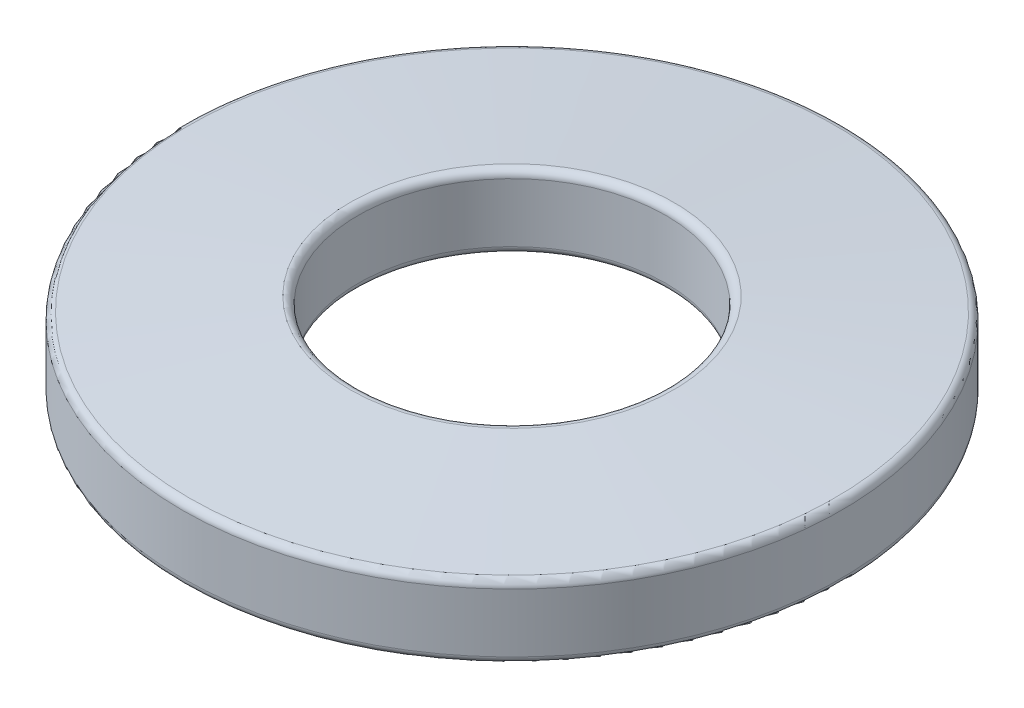
ISO-10303-21;
HEADER;
FILE_DESCRIPTION(('STEP AP214'),'2;1');
FILE_NAME('part.step','',(''),(''),'','','');
FILE_SCHEMA(('AUTOMOTIVE_DESIGN { 1 0 10303 214 1 1 1 1 }'));
ENDSEC;
DATA;
#1=APPLICATION_CONTEXT('core data for automotive mechanical design processes');
#2=APPLICATION_PROTOCOL_DEFINITION('international standard','automotive_design',2000,#1);
#3=PRODUCT_CONTEXT('',#1,'mechanical');
#4=PRODUCT('Part','Part','',(#3));
#5=PRODUCT_RELATED_PRODUCT_CATEGORY('part','',(#4));
#6=PRODUCT_DEFINITION_FORMATION('','',#4);
#7=PRODUCT_DEFINITION_CONTEXT('part definition',#1,'design');
#8=PRODUCT_DEFINITION('design','',#6,#7);
#9=PRODUCT_DEFINITION_SHAPE('','',#8);
#10=(LENGTH_UNIT() NAMED_UNIT(*) SI_UNIT(.MILLI.,.METRE.));
#11=(NAMED_UNIT(*) PLANE_ANGLE_UNIT() SI_UNIT($,.RADIAN.));
#12=(NAMED_UNIT(*) SI_UNIT($,.STERADIAN.) SOLID_ANGLE_UNIT());
#13=UNCERTAINTY_MEASURE_WITH_UNIT(LENGTH_MEASURE(1.E-05),#10,'distance_accuracy_value','');
#14=(GEOMETRIC_REPRESENTATION_CONTEXT(3) GLOBAL_UNCERTAINTY_ASSIGNED_CONTEXT((#13)) GLOBAL_UNIT_ASSIGNED_CONTEXT((#10,
#11,#12)) REPRESENTATION_CONTEXT('',''));
#15=CARTESIAN_POINT('',(0.,0.,0.));
#16=DIRECTION('',(0.,0.,1.));
#17=DIRECTION('',(1.,0.,0.));
#18=AXIS2_PLACEMENT_3D('',#15,#16,#17);
#19=CARTESIAN_POINT('',(0.,2.54,0.));
#20=DIRECTION('',(0.,-1.,0.));
#21=DIRECTION('',(0.,0.,-1.));
#22=AXIS2_PLACEMENT_3D('',#19,#20,#21);
#23=CONICAL_SURFACE('',#22,11.3792,1.48713462305893);
#24=CARTESIAN_POINT('',(0.,2.55951989163783,0.));
#25=DIRECTION('',(0.,1.,0.));
#26=DIRECTION('',(0.,0.,1.));
#27=AXIS2_PLACEMENT_3D('',#24,#25,#26);
#28=CIRCLE('',#27,11.1464252922189);
#29=CARTESIAN_POINT('',(0.,2.55951989163783,11.1464252922189));
#30=VERTEX_POINT('',#29);
#31=EDGE_CURVE('E48',#30,#30,#28,.T.);
#32=ORIENTED_EDGE('',*,*,#31,.T.);
#33=EDGE_LOOP('',(#32));
#34=FACE_BOUND('',#33,.T.);
#35=CARTESIAN_POINT('',(0.,3.02492031092504,0.));
#36=DIRECTION('',(0.,1.,0.));
#37=DIRECTION('',(0.,0.,1.));
#38=AXIS2_PLACEMENT_3D('',#35,#36,#37);
#39=CIRCLE('',#38,5.59652529221891);
#40=CARTESIAN_POINT('',(0.,3.02492031092504,5.59652529221891));
#41=VERTEX_POINT('',#40);
#42=EDGE_CURVE('E52',#41,#41,#39,.F.);
#43=ORIENTED_EDGE('',*,*,#42,.T.);
#44=EDGE_LOOP('',(#43));
#45=FACE_BOUND('',#44,.T.);
#46=ADVANCED_FACE('F37',(#34,#45),#23,.T.);
#47=CARTESIAN_POINT('',(0.,0.,0.));
#48=DIRECTION('',(0.,-1.,0.));
#49=DIRECTION('',(0.,0.,-1.));
#50=AXIS2_PLACEMENT_3D('',#47,#48,#49);
#51=CYLINDRICAL_SURFACE('',#50,5.3213);
#52=CARTESIAN_POINT('',(0.,0.741591718072637,0.));
#53=DIRECTION('',(0.,1.,0.));
#54=DIRECTION('',(0.,0.,1.));
#55=AXIS2_PLACEMENT_3D('',#52,#53,#54);
#56=CIRCLE('',#55,5.3213);
#57=CARTESIAN_POINT('',(0.,0.741591718072637,5.3213));
#58=VERTEX_POINT('',#57);
#59=EDGE_CURVE('E10',#58,#58,#56,.F.);
#60=ORIENTED_EDGE('',*,*,#59,.T.);
#61=EDGE_LOOP('',(#60));
#62=FACE_BOUND('',#61,.T.);
#63=CARTESIAN_POINT('',(0.,2.77180870121458,0.));
#64=DIRECTION('',(0.,1.,0.));
#65=DIRECTION('',(0.,0.,1.));
#66=AXIS2_PLACEMENT_3D('',#63,#64,#65);
#67=CIRCLE('',#66,5.3213);
#68=CARTESIAN_POINT('',(0.,2.77180870121458,5.3213));
#69=VERTEX_POINT('',#68);
#70=EDGE_CURVE('E44',#69,#69,#67,.T.);
#71=ORIENTED_EDGE('',*,*,#70,.T.);
#72=EDGE_LOOP('',(#71));
#73=FACE_BOUND('',#72,.T.);
#74=ADVANCED_FACE('F85',(#62,#73),#51,.F.);
#75=CARTESIAN_POINT('',(0.,0.508000000000002,0.));
#76=DIRECTION('',(0.,-1.,0.));
#77=DIRECTION('',(0.,0.,-1.));
#78=AXIS2_PLACEMENT_3D('',#75,#76,#77);
#79=CONICAL_SURFACE('',#78,5.3213,1.48713462305893);
#80=CARTESIAN_POINT('',(0.,0.0230796890749605,0.));
#81=DIRECTION('',(0.,1.,0.));
#82=DIRECTION('',(0.,0.,1.));
#83=AXIS2_PLACEMENT_3D('',#80,#81,#82);
#84=CIRCLE('',#83,11.1039747077811);
#85=CARTESIAN_POINT('',(0.,0.0230796890749605,11.1039747077811));
#86=VERTEX_POINT('',#85);
#87=EDGE_CURVE('E63',#86,#86,#84,.F.);
#88=ORIENTED_EDGE('',*,*,#87,.T.);
#89=EDGE_LOOP('',(#88));
#90=FACE_BOUND('',#89,.T.);
#91=CARTESIAN_POINT('',(0.,0.488480108362174,0.));
#92=DIRECTION('',(0.,1.,0.));
#93=DIRECTION('',(0.,0.,1.));
#94=AXIS2_PLACEMENT_3D('',#91,#92,#93);
#95=CIRCLE('',#94,5.55407470778109);
#96=CARTESIAN_POINT('',(0.,0.488480108362174,5.55407470778109));
#97=VERTEX_POINT('',#96);
#98=EDGE_CURVE('E66',#97,#97,#95,.T.);
#99=ORIENTED_EDGE('',*,*,#98,.T.);
#100=EDGE_LOOP('',(#99));
#101=FACE_BOUND('',#100,.T.);
#102=ADVANCED_FACE('F70',(#90,#101),#79,.F.);
#103=CARTESIAN_POINT('',(0.,0.,0.));
#104=DIRECTION('',(0.,-1.,0.));
#105=DIRECTION('',(0.,0.,-1.));
#106=AXIS2_PLACEMENT_3D('',#103,#104,#105);
#107=CYLINDRICAL_SURFACE('',#106,11.3792);
#108=CARTESIAN_POINT('',(0.,0.276191298785424,0.));
#109=DIRECTION('',(0.,1.,0.));
#110=DIRECTION('',(0.,0.,1.));
#111=AXIS2_PLACEMENT_3D('',#108,#109,#110);
#112=CIRCLE('',#111,11.3792);
#113=CARTESIAN_POINT('',(0.,0.276191298785424,11.3792));
#114=VERTEX_POINT('',#113);
#115=EDGE_CURVE('E57',#114,#114,#112,.T.);
#116=ORIENTED_EDGE('',*,*,#115,.T.);
#117=EDGE_LOOP('',(#116));
#118=FACE_BOUND('',#117,.T.);
#119=CARTESIAN_POINT('',(0.,2.30640828192737,0.));
#120=DIRECTION('',(0.,1.,0.));
#121=DIRECTION('',(0.,0.,1.));
#122=AXIS2_PLACEMENT_3D('',#119,#120,#121);
#123=CIRCLE('',#122,11.3792);
#124=CARTESIAN_POINT('',(0.,2.30640828192737,11.3792));
#125=VERTEX_POINT('',#124);
#126=EDGE_CURVE('E60',#125,#125,#123,.F.);
#127=ORIENTED_EDGE('',*,*,#126,.T.);
#128=EDGE_LOOP('',(#127));
#129=FACE_BOUND('',#128,.T.);
#130=ADVANCED_FACE('F96',(#118,#129),#107,.T.);
#131=CARTESIAN_POINT('',(0.,0.276191298785424,0.));
#132=DIRECTION('',(0.,1.,0.));
#133=DIRECTION('',(0.,0.,1.));
#134=AXIS2_PLACEMENT_3D('',#131,#132,#133);
#135=TOROIDAL_SURFACE('',#134,11.1252,0.254);
#136=ORIENTED_EDGE('',*,*,#115,.F.);
#137=EDGE_LOOP('',(#136));
#138=FACE_BOUND('',#137,.T.);
#139=ORIENTED_EDGE('',*,*,#87,.F.);
#140=EDGE_LOOP('',(#139));
#141=FACE_BOUND('',#140,.T.);
#142=ADVANCED_FACE('F81',(#138,#141),#135,.T.);
#143=CARTESIAN_POINT('',(0.,2.30640828192737,0.));
#144=DIRECTION('',(0.,1.,0.));
#145=DIRECTION('',(0.,0.,1.));
#146=AXIS2_PLACEMENT_3D('',#143,#144,#145);
#147=TOROIDAL_SURFACE('',#146,11.1252,0.254);
#148=ORIENTED_EDGE('',*,*,#31,.F.);
#149=EDGE_LOOP('',(#148));
#150=FACE_BOUND('',#149,.T.);
#151=ORIENTED_EDGE('',*,*,#126,.F.);
#152=EDGE_LOOP('',(#151));
#153=FACE_BOUND('',#152,.T.);
#154=ADVANCED_FACE('F75',(#150,#153),#147,.T.);
#155=CARTESIAN_POINT('',(0.,0.741591718072637,0.));
#156=DIRECTION('',(0.,1.,0.));
#157=DIRECTION('',(0.,0.,1.));
#158=AXIS2_PLACEMENT_3D('',#155,#156,#157);
#159=TOROIDAL_SURFACE('',#158,5.5753,0.254);
#160=ORIENTED_EDGE('',*,*,#98,.F.);
#161=EDGE_LOOP('',(#160));
#162=FACE_BOUND('',#161,.T.);
#163=ORIENTED_EDGE('',*,*,#59,.F.);
#164=EDGE_LOOP('',(#163));
#165=FACE_BOUND('',#164,.T.);
#166=ADVANCED_FACE('F72',(#162,#165),#159,.T.);
#167=CARTESIAN_POINT('',(0.,2.77180870121458,0.));
#168=DIRECTION('',(0.,1.,0.));
#169=DIRECTION('',(0.,0.,1.));
#170=AXIS2_PLACEMENT_3D('',#167,#168,#169);
#171=TOROIDAL_SURFACE('',#170,5.5753,0.254);
#172=ORIENTED_EDGE('',*,*,#70,.F.);
#173=EDGE_LOOP('',(#172));
#174=FACE_BOUND('',#173,.T.);
#175=ORIENTED_EDGE('',*,*,#42,.F.);
#176=EDGE_LOOP('',(#175));
#177=FACE_BOUND('',#176,.T.);
#178=ADVANCED_FACE('F39',(#174,#177),#171,.T.);
#179=CLOSED_SHELL('',(#46,#74,#102,#130,#142,#154,#166,#178));
#180=MANIFOLD_SOLID_BREP('B2',#179);
#181=ADVANCED_BREP_SHAPE_REPRESENTATION('',(#18,#180),#14);
#182=SHAPE_DEFINITION_REPRESENTATION(#9,#181);
ENDSEC;
END-ISO-10303-21;
